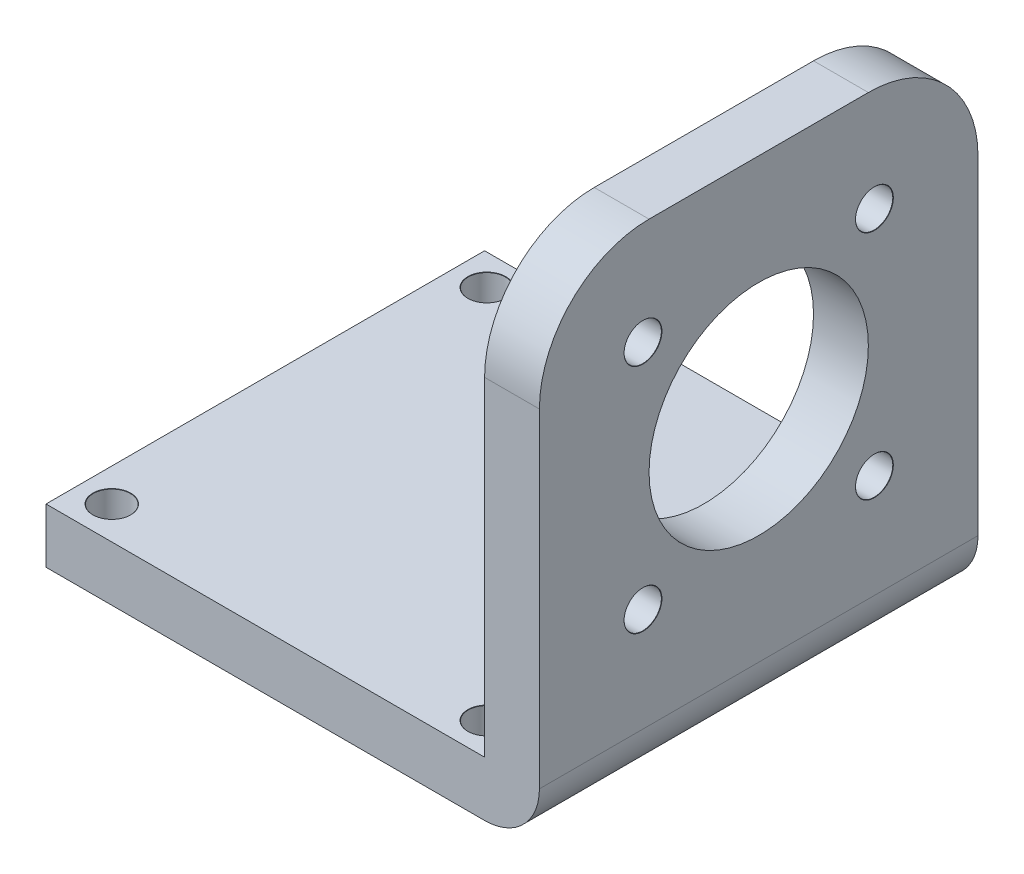
ISO-10303-21;
HEADER;
FILE_DESCRIPTION(('STEP AP214'),'2;1');
FILE_NAME('part.step','',(''),(''),'','','');
FILE_SCHEMA(('AUTOMOTIVE_DESIGN { 1 0 10303 214 1 1 1 1 }'));
ENDSEC;
DATA;
#1=APPLICATION_CONTEXT('core data for automotive mechanical design processes');
#2=APPLICATION_PROTOCOL_DEFINITION('international standard','automotive_design',2000,#1);
#3=PRODUCT_CONTEXT('',#1,'mechanical');
#4=PRODUCT('Part','Part','',(#3));
#5=PRODUCT_RELATED_PRODUCT_CATEGORY('part','',(#4));
#6=PRODUCT_DEFINITION_FORMATION('','',#4);
#7=PRODUCT_DEFINITION_CONTEXT('part definition',#1,'design');
#8=PRODUCT_DEFINITION('design','',#6,#7);
#9=PRODUCT_DEFINITION_SHAPE('','',#8);
#10=(LENGTH_UNIT() NAMED_UNIT(*) SI_UNIT(.MILLI.,.METRE.));
#11=(NAMED_UNIT(*) PLANE_ANGLE_UNIT() SI_UNIT($,.RADIAN.));
#12=(NAMED_UNIT(*) SI_UNIT($,.STERADIAN.) SOLID_ANGLE_UNIT());
#13=UNCERTAINTY_MEASURE_WITH_UNIT(LENGTH_MEASURE(1.E-05),#10,'distance_accuracy_value','');
#14=(GEOMETRIC_REPRESENTATION_CONTEXT(3) GLOBAL_UNCERTAINTY_ASSIGNED_CONTEXT((#13)) GLOBAL_UNIT_ASSIGNED_CONTEXT((#10,
#11,#12)) REPRESENTATION_CONTEXT('',''));
#15=CARTESIAN_POINT('',(0.,0.,0.));
#16=DIRECTION('',(0.,0.,1.));
#17=DIRECTION('',(1.,0.,0.));
#18=AXIS2_PLACEMENT_3D('',#15,#16,#17);
#19=CARTESIAN_POINT('',(25.,35.,-10.));
#20=DIRECTION('',(-1.,0.,0.));
#21=DIRECTION('',(0.,0.,1.));
#22=AXIS2_PLACEMENT_3D('',#19,#20,#21);
#23=CYLINDRICAL_SURFACE('',#22,10.);
#24=DIRECTION('',(-1.,0.,0.));
#25=VECTOR('',#24,1.);
#26=CARTESIAN_POINT('',(25.,45.,-10.));
#27=LINE('',#26,#25);
#28=CARTESIAN_POINT('',(25.,45.,-10.));
#29=VERTEX_POINT('',#28);
#30=CARTESIAN_POINT('',(20.,45.,-10.));
#31=VERTEX_POINT('',#30);
#32=EDGE_CURVE('E185',#29,#31,#27,.T.);
#33=ORIENTED_EDGE('',*,*,#32,.F.);
#34=CARTESIAN_POINT('',(25.,35.,-10.));
#35=DIRECTION('',(1.,0.,0.));
#36=DIRECTION('',(0.,0.,-1.));
#37=AXIS2_PLACEMENT_3D('',#34,#35,#36);
#38=CIRCLE('',#37,10.);
#39=CARTESIAN_POINT('',(25.,35.,-20.));
#40=VERTEX_POINT('',#39);
#41=EDGE_CURVE('E193',#40,#29,#38,.T.);
#42=ORIENTED_EDGE('',*,*,#41,.F.);
#43=DIRECTION('',(-1.,0.,0.));
#44=VECTOR('',#43,1.);
#45=CARTESIAN_POINT('',(20.,35.,-20.));
#46=LINE('',#45,#44);
#47=CARTESIAN_POINT('',(20.,35.,-20.));
#48=VERTEX_POINT('',#47);
#49=EDGE_CURVE('E189',#48,#40,#46,.F.);
#50=ORIENTED_EDGE('',*,*,#49,.F.);
#51=CARTESIAN_POINT('',(20.,35.,-10.));
#52=DIRECTION('',(1.,0.,0.));
#53=DIRECTION('',(0.,0.,-1.));
#54=AXIS2_PLACEMENT_3D('',#51,#52,#53);
#55=CIRCLE('',#54,10.);
#56=EDGE_CURVE('E196',#31,#48,#55,.F.);
#57=ORIENTED_EDGE('',*,*,#56,.F.);
#58=EDGE_LOOP('',(#33,#42,#50,#57));
#59=FACE_BOUND('',#58,.T.);
#60=ADVANCED_FACE('F45',(#59),#23,.T.);
#61=CARTESIAN_POINT('',(25.,35.,10.));
#62=DIRECTION('',(1.,0.,0.));
#63=DIRECTION('',(0.,0.,-1.));
#64=AXIS2_PLACEMENT_3D('',#61,#62,#63);
#65=CYLINDRICAL_SURFACE('',#64,10.);
#66=DIRECTION('',(1.,0.,0.));
#67=VECTOR('',#66,1.);
#68=CARTESIAN_POINT('',(25.,45.,10.));
#69=LINE('',#68,#67);
#70=CARTESIAN_POINT('',(20.,45.,10.));
#71=VERTEX_POINT('',#70);
#72=CARTESIAN_POINT('',(25.,45.,10.));
#73=VERTEX_POINT('',#72);
#74=EDGE_CURVE('E173',#71,#73,#69,.T.);
#75=ORIENTED_EDGE('',*,*,#74,.F.);
#76=CARTESIAN_POINT('',(20.,35.,10.));
#77=DIRECTION('',(1.,0.,0.));
#78=DIRECTION('',(0.,0.,-1.));
#79=AXIS2_PLACEMENT_3D('',#76,#77,#78);
#80=CIRCLE('',#79,10.);
#81=CARTESIAN_POINT('',(20.,35.,20.));
#82=VERTEX_POINT('',#81);
#83=EDGE_CURVE('E179',#82,#71,#80,.F.);
#84=ORIENTED_EDGE('',*,*,#83,.F.);
#85=DIRECTION('',(1.,0.,0.));
#86=VECTOR('',#85,1.);
#87=CARTESIAN_POINT('',(20.,35.,20.));
#88=LINE('',#87,#86);
#89=CARTESIAN_POINT('',(25.,35.,20.));
#90=VERTEX_POINT('',#89);
#91=EDGE_CURVE('E126',#90,#82,#88,.F.);
#92=ORIENTED_EDGE('',*,*,#91,.F.);
#93=CARTESIAN_POINT('',(25.,35.,10.));
#94=DIRECTION('',(1.,0.,0.));
#95=DIRECTION('',(0.,0.,-1.));
#96=AXIS2_PLACEMENT_3D('',#93,#94,#95);
#97=CIRCLE('',#96,10.);
#98=EDGE_CURVE('E182',#73,#90,#97,.T.);
#99=ORIENTED_EDGE('',*,*,#98,.F.);
#100=EDGE_LOOP('',(#75,#84,#92,#99));
#101=FACE_BOUND('',#100,.T.);
#102=ADVANCED_FACE('F273',(#101),#65,.T.);
#103=CARTESIAN_POINT('',(-20.,5.,20.));
#104=DIRECTION('',(1.,0.,0.));
#105=DIRECTION('',(0.,0.,-1.));
#106=AXIS2_PLACEMENT_3D('',#103,#104,#105);
#107=PLANE('',#106);
#108=DIRECTION('',(0.,0.,1.));
#109=VECTOR('',#108,1.);
#110=CARTESIAN_POINT('',(-20.,0.,20.));
#111=LINE('',#110,#109);
#112=CARTESIAN_POINT('',(-20.,0.,-20.));
#113=VERTEX_POINT('',#112);
#114=CARTESIAN_POINT('',(-20.,0.,20.));
#115=VERTEX_POINT('',#114);
#116=EDGE_CURVE('E157',#113,#115,#111,.T.);
#117=ORIENTED_EDGE('',*,*,#116,.T.);
#118=DIRECTION('',(0.,-1.,0.));
#119=VECTOR('',#118,1.);
#120=CARTESIAN_POINT('',(-20.,5.,20.));
#121=LINE('',#120,#119);
#122=CARTESIAN_POINT('',(-20.,5.,20.));
#123=VERTEX_POINT('',#122);
#124=EDGE_CURVE('E170',#123,#115,#121,.T.);
#125=ORIENTED_EDGE('',*,*,#124,.F.);
#126=DIRECTION('',(0.,0.,1.));
#127=VECTOR('',#126,1.);
#128=CARTESIAN_POINT('',(-20.,5.,20.));
#129=LINE('',#128,#127);
#130=CARTESIAN_POINT('',(-20.,5.,-20.));
#131=VERTEX_POINT('',#130);
#132=EDGE_CURVE('E145',#131,#123,#129,.T.);
#133=ORIENTED_EDGE('',*,*,#132,.F.);
#134=DIRECTION('',(0.,-1.,0.));
#135=VECTOR('',#134,1.);
#136=CARTESIAN_POINT('',(-20.,5.,-20.));
#137=LINE('',#136,#135);
#138=EDGE_CURVE('E156',#131,#113,#137,.T.);
#139=ORIENTED_EDGE('',*,*,#138,.T.);
#140=EDGE_LOOP('',(#117,#125,#133,#139));
#141=FACE_BOUND('',#140,.T.);
#142=ADVANCED_FACE('F284',(#141),#107,.F.);
#143=CARTESIAN_POINT('',(20.,5.,20.));
#144=DIRECTION('',(0.,0.,-1.));
#145=DIRECTION('',(-1.,0.,0.));
#146=AXIS2_PLACEMENT_3D('',#143,#144,#145);
#147=PLANE('',#146);
#148=DIRECTION('',(1.,0.,0.));
#149=VECTOR('',#148,1.);
#150=CARTESIAN_POINT('',(20.,0.,20.));
#151=LINE('',#150,#149);
#152=CARTESIAN_POINT('',(20.,0.,20.));
#153=VERTEX_POINT('',#152);
#154=EDGE_CURVE('E161',#115,#153,#151,.T.);
#155=ORIENTED_EDGE('',*,*,#154,.T.);
#156=CARTESIAN_POINT('',(20.,5.,20.));
#157=DIRECTION('',(0.,0.,-1.));
#158=DIRECTION('',(-1.,0.,0.));
#159=AXIS2_PLACEMENT_3D('',#156,#157,#158);
#160=CIRCLE('',#159,5.);
#161=CARTESIAN_POINT('',(25.,5.,20.));
#162=VERTEX_POINT('',#161);
#163=EDGE_CURVE('E11',#153,#162,#160,.F.);
#164=ORIENTED_EDGE('',*,*,#163,.T.);
#165=DIRECTION('',(0.,-1.,0.));
#166=VECTOR('',#165,1.);
#167=CARTESIAN_POINT('',(25.,5.,20.));
#168=LINE('',#167,#166);
#169=EDGE_CURVE('E254',#90,#162,#168,.T.);
#170=ORIENTED_EDGE('',*,*,#169,.F.);
#171=ORIENTED_EDGE('',*,*,#91,.T.);
#172=DIRECTION('',(0.,-1.,0.));
#173=VECTOR('',#172,1.);
#174=CARTESIAN_POINT('',(20.,5.,20.));
#175=LINE('',#174,#173);
#176=CARTESIAN_POINT('',(20.,5.,20.));
#177=VERTEX_POINT('',#176);
#178=EDGE_CURVE('E117',#82,#177,#175,.T.);
#179=ORIENTED_EDGE('',*,*,#178,.T.);
#180=DIRECTION('',(1.,0.,0.));
#181=VECTOR('',#180,1.);
#182=CARTESIAN_POINT('',(20.,5.,20.));
#183=LINE('',#182,#181);
#184=EDGE_CURVE('E122',#123,#177,#183,.T.);
#185=ORIENTED_EDGE('',*,*,#184,.F.);
#186=ORIENTED_EDGE('',*,*,#124,.T.);
#187=EDGE_LOOP('',(#155,#164,#170,#171,#179,#185,#186));
#188=FACE_BOUND('',#187,.T.);
#189=ADVANCED_FACE('F119',(#188),#147,.F.);
#190=CARTESIAN_POINT('',(20.,5.,-20.));
#191=DIRECTION('',(0.,0.,1.));
#192=DIRECTION('',(1.,0.,0.));
#193=AXIS2_PLACEMENT_3D('',#190,#191,#192);
#194=PLANE('',#193);
#195=DIRECTION('',(0.,1.,0.));
#196=VECTOR('',#195,1.);
#197=CARTESIAN_POINT('',(25.,5.,-20.));
#198=LINE('',#197,#196);
#199=CARTESIAN_POINT('',(25.,5.,-20.));
#200=VERTEX_POINT('',#199);
#201=EDGE_CURVE('E258',#200,#40,#198,.T.);
#202=ORIENTED_EDGE('',*,*,#201,.F.);
#203=CARTESIAN_POINT('',(20.,5.,-20.));
#204=DIRECTION('',(0.,0.,1.));
#205=DIRECTION('',(1.,0.,0.));
#206=AXIS2_PLACEMENT_3D('',#203,#204,#205);
#207=CIRCLE('',#206,5.);
#208=CARTESIAN_POINT('',(20.,0.,-20.));
#209=VERTEX_POINT('',#208);
#210=EDGE_CURVE('E70',#200,#209,#207,.F.);
#211=ORIENTED_EDGE('',*,*,#210,.T.);
#212=DIRECTION('',(-1.,0.,0.));
#213=VECTOR('',#212,1.);
#214=CARTESIAN_POINT('',(20.,0.,-20.));
#215=LINE('',#214,#213);
#216=EDGE_CURVE('E150',#209,#113,#215,.T.);
#217=ORIENTED_EDGE('',*,*,#216,.T.);
#218=ORIENTED_EDGE('',*,*,#138,.F.);
#219=DIRECTION('',(-1.,0.,0.));
#220=VECTOR('',#219,1.);
#221=CARTESIAN_POINT('',(20.,5.,-20.));
#222=LINE('',#221,#220);
#223=CARTESIAN_POINT('',(20.,5.,-20.));
#224=VERTEX_POINT('',#223);
#225=EDGE_CURVE('E141',#224,#131,#222,.T.);
#226=ORIENTED_EDGE('',*,*,#225,.F.);
#227=DIRECTION('',(0.,1.,0.));
#228=VECTOR('',#227,1.);
#229=CARTESIAN_POINT('',(20.,5.,-20.));
#230=LINE('',#229,#228);
#231=EDGE_CURVE('E130',#224,#48,#230,.T.);
#232=ORIENTED_EDGE('',*,*,#231,.T.);
#233=ORIENTED_EDGE('',*,*,#49,.T.);
#234=EDGE_LOOP('',(#202,#211,#217,#218,#226,#232,#233));
#235=FACE_BOUND('',#234,.T.);
#236=ADVANCED_FACE('F280',(#235),#194,.F.);
#237=CARTESIAN_POINT('',(0.,5.,0.));
#238=DIRECTION('',(0.,1.,0.));
#239=DIRECTION('',(0.,0.,1.));
#240=AXIS2_PLACEMENT_3D('',#237,#238,#239);
#241=PLANE('',#240);
#242=CARTESIAN_POINT('',(-17.0000000000002,5.,-17.1998167393278));
#243=DIRECTION('',(0.,1.,0.));
#244=DIRECTION('',(0.,0.,1.));
#245=AXIS2_PLACEMENT_3D('',#242,#243,#244);
#246=CIRCLE('',#245,1.725);
#247=CARTESIAN_POINT('',(-17.0000000000002,5.,-15.4748167393278));
#248=VERTEX_POINT('',#247);
#249=EDGE_CURVE('E391',#248,#248,#246,.T.);
#250=ORIENTED_EDGE('',*,*,#249,.F.);
#251=EDGE_LOOP('',(#250));
#252=FACE_BOUND('',#251,.T.);
#253=CARTESIAN_POINT('',(17.199816739328,5.,-17.199816739328));
#254=DIRECTION('',(0.,1.,0.));
#255=DIRECTION('',(0.,0.,1.));
#256=AXIS2_PLACEMENT_3D('',#253,#254,#255);
#257=CIRCLE('',#256,1.725);
#258=CARTESIAN_POINT('',(17.199816739328,5.,-15.474816739328));
#259=VERTEX_POINT('',#258);
#260=EDGE_CURVE('E401',#259,#259,#257,.T.);
#261=ORIENTED_EDGE('',*,*,#260,.F.);
#262=EDGE_LOOP('',(#261));
#263=FACE_BOUND('',#262,.T.);
#264=CARTESIAN_POINT('',(17.199816739328,5.,16.9999999999999));
#265=DIRECTION('',(0.,1.,0.));
#266=DIRECTION('',(0.,0.,1.));
#267=AXIS2_PLACEMENT_3D('',#264,#265,#266);
#268=CIRCLE('',#267,1.725);
#269=CARTESIAN_POINT('',(17.199816739328,5.,18.7249999999999));
#270=VERTEX_POINT('',#269);
#271=EDGE_CURVE('E413',#270,#270,#268,.T.);
#272=ORIENTED_EDGE('',*,*,#271,.F.);
#273=EDGE_LOOP('',(#272));
#274=FACE_BOUND('',#273,.T.);
#275=CARTESIAN_POINT('',(-17.,5.,17.));
#276=DIRECTION('',(0.,1.,0.));
#277=DIRECTION('',(0.,0.,1.));
#278=AXIS2_PLACEMENT_3D('',#275,#276,#277);
#279=CIRCLE('',#278,1.725);
#280=CARTESIAN_POINT('',(-17.,5.,18.725));
#281=VERTEX_POINT('',#280);
#282=EDGE_CURVE('E425',#281,#281,#279,.T.);
#283=ORIENTED_EDGE('',*,*,#282,.F.);
#284=EDGE_LOOP('',(#283));
#285=FACE_BOUND('',#284,.T.);
#286=ORIENTED_EDGE('',*,*,#132,.T.);
#287=ORIENTED_EDGE('',*,*,#184,.T.);
#288=DIRECTION('',(0.,0.,-1.));
#289=VECTOR('',#288,1.);
#290=CARTESIAN_POINT('',(20.,5.,20.));
#291=LINE('',#290,#289);
#292=EDGE_CURVE('E134',#177,#224,#291,.T.);
#293=ORIENTED_EDGE('',*,*,#292,.T.);
#294=ORIENTED_EDGE('',*,*,#225,.T.);
#295=EDGE_LOOP('',(#286,#287,#293,#294));
#296=FACE_BOUND('',#295,.T.);
#297=ADVANCED_FACE('F143',(#252,#263,#274,#285,#296),#241,.T.);
#298=CARTESIAN_POINT('',(0.,0.,0.));
#299=DIRECTION('',(0.,1.,0.));
#300=DIRECTION('',(0.,0.,1.));
#301=AXIS2_PLACEMENT_3D('',#298,#299,#300);
#302=PLANE('',#301);
#303=CARTESIAN_POINT('',(-17.0000000000002,0.,-17.1998167393278));
#304=DIRECTION('',(0.,1.,0.));
#305=DIRECTION('',(0.,0.,1.));
#306=AXIS2_PLACEMENT_3D('',#303,#304,#305);
#307=CIRCLE('',#306,1.69999999999999);
#308=CARTESIAN_POINT('',(-17.0000000000002,0.,-15.4998167393278));
#309=VERTEX_POINT('',#308);
#310=EDGE_CURVE('E395',#309,#309,#307,.T.);
#311=ORIENTED_EDGE('',*,*,#310,.T.);
#312=EDGE_LOOP('',(#311));
#313=FACE_BOUND('',#312,.T.);
#314=CARTESIAN_POINT('',(17.199816739328,0.,-17.199816739328));
#315=DIRECTION('',(0.,1.,0.));
#316=DIRECTION('',(0.,0.,1.));
#317=AXIS2_PLACEMENT_3D('',#314,#315,#316);
#318=CIRCLE('',#317,1.69999999999999);
#319=CARTESIAN_POINT('',(17.199816739328,0.,-15.499816739328));
#320=VERTEX_POINT('',#319);
#321=EDGE_CURVE('E409',#320,#320,#318,.T.);
#322=ORIENTED_EDGE('',*,*,#321,.T.);
#323=EDGE_LOOP('',(#322));
#324=FACE_BOUND('',#323,.T.);
#325=CARTESIAN_POINT('',(17.199816739328,0.,16.9999999999999));
#326=DIRECTION('',(0.,1.,0.));
#327=DIRECTION('',(0.,0.,1.));
#328=AXIS2_PLACEMENT_3D('',#325,#326,#327);
#329=CIRCLE('',#328,1.69999999999999);
#330=CARTESIAN_POINT('',(17.199816739328,0.,18.6999999999999));
#331=VERTEX_POINT('',#330);
#332=EDGE_CURVE('E421',#331,#331,#329,.T.);
#333=ORIENTED_EDGE('',*,*,#332,.T.);
#334=EDGE_LOOP('',(#333));
#335=FACE_BOUND('',#334,.T.);
#336=CARTESIAN_POINT('',(-17.,0.,17.));
#337=DIRECTION('',(0.,1.,0.));
#338=DIRECTION('',(0.,0.,1.));
#339=AXIS2_PLACEMENT_3D('',#336,#337,#338);
#340=CIRCLE('',#339,1.69999999999999);
#341=CARTESIAN_POINT('',(-17.,0.,18.7));
#342=VERTEX_POINT('',#341);
#343=EDGE_CURVE('E433',#342,#342,#340,.T.);
#344=ORIENTED_EDGE('',*,*,#343,.T.);
#345=EDGE_LOOP('',(#344));
#346=FACE_BOUND('',#345,.T.);
#347=ORIENTED_EDGE('',*,*,#216,.F.);
#348=DIRECTION('',(0.,0.,-1.));
#349=VECTOR('',#348,1.);
#350=CARTESIAN_POINT('',(20.,0.,20.));
#351=LINE('',#350,#349);
#352=EDGE_CURVE('E55',#209,#153,#351,.F.);
#353=ORIENTED_EDGE('',*,*,#352,.T.);
#354=ORIENTED_EDGE('',*,*,#154,.F.);
#355=ORIENTED_EDGE('',*,*,#116,.F.);
#356=EDGE_LOOP('',(#347,#353,#354,#355));
#357=FACE_BOUND('',#356,.T.);
#358=ADVANCED_FACE('F310',(#313,#324,#335,#346,#357),#302,.F.);
#359=CARTESIAN_POINT('',(25.,45.,20.));
#360=DIRECTION('',(0.,-1.,0.));
#361=DIRECTION('',(0.,0.,-1.));
#362=AXIS2_PLACEMENT_3D('',#359,#360,#361);
#363=PLANE('',#362);
#364=DIRECTION('',(0.,0.,1.));
#365=VECTOR('',#364,1.);
#366=CARTESIAN_POINT('',(25.,45.,20.));
#367=LINE('',#366,#365);
#368=EDGE_CURVE('E162',#29,#73,#367,.T.);
#369=ORIENTED_EDGE('',*,*,#368,.F.);
#370=ORIENTED_EDGE('',*,*,#32,.T.);
#371=DIRECTION('',(0.,0.,1.));
#372=VECTOR('',#371,1.);
#373=CARTESIAN_POINT('',(20.,45.,20.));
#374=LINE('',#373,#372);
#375=EDGE_CURVE('E259',#31,#71,#374,.T.);
#376=ORIENTED_EDGE('',*,*,#375,.T.);
#377=ORIENTED_EDGE('',*,*,#74,.T.);
#378=EDGE_LOOP('',(#369,#370,#376,#377));
#379=FACE_BOUND('',#378,.T.);
#380=ADVANCED_FACE('F268',(#379),#363,.F.);
#381=CARTESIAN_POINT('',(25.,0.,0.));
#382=DIRECTION('',(1.,0.,0.));
#383=DIRECTION('',(0.,0.,-1.));
#384=AXIS2_PLACEMENT_3D('',#381,#382,#383);
#385=PLANE('',#384);
#386=CARTESIAN_POINT('',(25.,14.4465067463817,10.5534932536183));
#387=DIRECTION('',(1.,0.,0.));
#388=DIRECTION('',(0.,0.,-1.));
#389=AXIS2_PLACEMENT_3D('',#386,#387,#388);
#390=CIRCLE('',#389,1.725);
#391=CARTESIAN_POINT('',(25.,14.4465067463817,8.82849325361828));
#392=VERTEX_POINT('',#391);
#393=EDGE_CURVE('E437',#392,#392,#390,.T.);
#394=ORIENTED_EDGE('',*,*,#393,.F.);
#395=EDGE_LOOP('',(#394));
#396=FACE_BOUND('',#395,.T.);
#397=CARTESIAN_POINT('',(25.,14.4465067463818,-10.5534932536184));
#398=DIRECTION('',(1.,0.,0.));
#399=DIRECTION('',(0.,0.,-1.));
#400=AXIS2_PLACEMENT_3D('',#397,#398,#399);
#401=CIRCLE('',#400,1.725);
#402=CARTESIAN_POINT('',(25.,14.4465067463818,-12.2784932536184));
#403=VERTEX_POINT('',#402);
#404=EDGE_CURVE('E230',#403,#403,#401,.T.);
#405=ORIENTED_EDGE('',*,*,#404,.F.);
#406=EDGE_LOOP('',(#405));
#407=FACE_BOUND('',#406,.T.);
#408=CARTESIAN_POINT('',(25.,35.5534932536184,-10.5534932536182));
#409=DIRECTION('',(1.,0.,0.));
#410=DIRECTION('',(0.,0.,-1.));
#411=AXIS2_PLACEMENT_3D('',#408,#409,#410);
#412=CIRCLE('',#411,1.725);
#413=CARTESIAN_POINT('',(25.,35.5534932536184,-12.2784932536182));
#414=VERTEX_POINT('',#413);
#415=EDGE_CURVE('E221',#414,#414,#412,.T.);
#416=ORIENTED_EDGE('',*,*,#415,.F.);
#417=EDGE_LOOP('',(#416));
#418=FACE_BOUND('',#417,.T.);
#419=CARTESIAN_POINT('',(25.,35.5534932536182,10.5534932536184));
#420=DIRECTION('',(1.,0.,0.));
#421=DIRECTION('',(0.,0.,-1.));
#422=AXIS2_PLACEMENT_3D('',#419,#420,#421);
#423=CIRCLE('',#422,1.725);
#424=CARTESIAN_POINT('',(25.,35.5534932536182,8.82849325361843));
#425=VERTEX_POINT('',#424);
#426=EDGE_CURVE('E216',#425,#425,#423,.T.);
#427=ORIENTED_EDGE('',*,*,#426,.F.);
#428=EDGE_LOOP('',(#427));
#429=FACE_BOUND('',#428,.T.);
#430=CARTESIAN_POINT('',(25.,25.,0.));
#431=DIRECTION('',(-1.,0.,0.));
#432=DIRECTION('',(0.,0.,1.));
#433=AXIS2_PLACEMENT_3D('',#430,#431,#432);
#434=CIRCLE('',#433,10.);
#435=CARTESIAN_POINT('',(25.,25.,10.));
#436=VERTEX_POINT('',#435);
#437=EDGE_CURVE('E131',#436,#436,#434,.T.);
#438=ORIENTED_EDGE('',*,*,#437,.T.);
#439=EDGE_LOOP('',(#438));
#440=FACE_BOUND('',#439,.T.);
#441=ORIENTED_EDGE('',*,*,#169,.T.);
#442=DIRECTION('',(0.,0.,-1.));
#443=VECTOR('',#442,1.);
#444=CARTESIAN_POINT('',(25.,5.,-20.));
#445=LINE('',#444,#443);
#446=EDGE_CURVE('E199',#162,#200,#445,.T.);
#447=ORIENTED_EDGE('',*,*,#446,.T.);
#448=ORIENTED_EDGE('',*,*,#201,.T.);
#449=ORIENTED_EDGE('',*,*,#41,.T.);
#450=ORIENTED_EDGE('',*,*,#368,.T.);
#451=ORIENTED_EDGE('',*,*,#98,.T.);
#452=EDGE_LOOP('',(#441,#447,#448,#449,#450,#451));
#453=FACE_BOUND('',#452,.T.);
#454=ADVANCED_FACE('F275',(#396,#407,#418,#429,#440,#453),#385,.T.);
#455=CARTESIAN_POINT('',(20.,0.,0.));
#456=DIRECTION('',(1.,0.,0.));
#457=DIRECTION('',(0.,0.,-1.));
#458=AXIS2_PLACEMENT_3D('',#455,#456,#457);
#459=PLANE('',#458);
#460=CARTESIAN_POINT('',(20.,14.4465067463817,10.5534932536183));
#461=DIRECTION('',(1.,0.,0.));
#462=DIRECTION('',(0.,0.,-1.));
#463=AXIS2_PLACEMENT_3D('',#460,#461,#462);
#464=CIRCLE('',#463,1.69999999999999);
#465=CARTESIAN_POINT('',(20.,14.4465067463817,8.85349325361829));
#466=VERTEX_POINT('',#465);
#467=EDGE_CURVE('E49',#466,#466,#464,.T.);
#468=ORIENTED_EDGE('',*,*,#467,.T.);
#469=EDGE_LOOP('',(#468));
#470=FACE_BOUND('',#469,.T.);
#471=CARTESIAN_POINT('',(20.,14.4465067463818,-10.5534932536184));
#472=DIRECTION('',(1.,0.,0.));
#473=DIRECTION('',(0.,0.,-1.));
#474=AXIS2_PLACEMENT_3D('',#471,#472,#473);
#475=CIRCLE('',#474,1.69999999999999);
#476=CARTESIAN_POINT('',(20.,14.4465067463818,-12.2534932536184));
#477=VERTEX_POINT('',#476);
#478=EDGE_CURVE('E218',#477,#477,#475,.T.);
#479=ORIENTED_EDGE('',*,*,#478,.T.);
#480=EDGE_LOOP('',(#479));
#481=FACE_BOUND('',#480,.T.);
#482=CARTESIAN_POINT('',(20.,35.5534932536184,-10.5534932536182));
#483=DIRECTION('',(1.,0.,0.));
#484=DIRECTION('',(0.,0.,-1.));
#485=AXIS2_PLACEMENT_3D('',#482,#483,#484);
#486=CIRCLE('',#485,1.69999999999999);
#487=CARTESIAN_POINT('',(20.,35.5534932536184,-12.2534932536182));
#488=VERTEX_POINT('',#487);
#489=EDGE_CURVE('E213',#488,#488,#486,.T.);
#490=ORIENTED_EDGE('',*,*,#489,.T.);
#491=EDGE_LOOP('',(#490));
#492=FACE_BOUND('',#491,.T.);
#493=CARTESIAN_POINT('',(20.,35.5534932536182,10.5534932536184));
#494=DIRECTION('',(1.,0.,0.));
#495=DIRECTION('',(0.,0.,-1.));
#496=AXIS2_PLACEMENT_3D('',#493,#494,#495);
#497=CIRCLE('',#496,1.69999999999999);
#498=CARTESIAN_POINT('',(20.,35.5534932536182,8.85349325361844));
#499=VERTEX_POINT('',#498);
#500=EDGE_CURVE('E207',#499,#499,#497,.T.);
#501=ORIENTED_EDGE('',*,*,#500,.T.);
#502=EDGE_LOOP('',(#501));
#503=FACE_BOUND('',#502,.T.);
#504=CARTESIAN_POINT('',(20.,25.,0.));
#505=DIRECTION('',(-1.,0.,0.));
#506=DIRECTION('',(0.,0.,1.));
#507=AXIS2_PLACEMENT_3D('',#504,#505,#506);
#508=CIRCLE('',#507,10.);
#509=CARTESIAN_POINT('',(20.,25.,10.));
#510=VERTEX_POINT('',#509);
#511=EDGE_CURVE('E211',#510,#510,#508,.T.);
#512=ORIENTED_EDGE('',*,*,#511,.F.);
#513=EDGE_LOOP('',(#512));
#514=FACE_BOUND('',#513,.T.);
#515=ORIENTED_EDGE('',*,*,#375,.F.);
#516=ORIENTED_EDGE('',*,*,#56,.T.);
#517=ORIENTED_EDGE('',*,*,#231,.F.);
#518=ORIENTED_EDGE('',*,*,#292,.F.);
#519=ORIENTED_EDGE('',*,*,#178,.F.);
#520=ORIENTED_EDGE('',*,*,#83,.T.);
#521=EDGE_LOOP('',(#515,#516,#517,#518,#519,#520));
#522=FACE_BOUND('',#521,.T.);
#523=ADVANCED_FACE('F136',(#470,#481,#492,#503,#514,#522),#459,.F.);
#524=CARTESIAN_POINT('',(20.,5.,0.));
#525=DIRECTION('',(0.,0.,1.));
#526=DIRECTION('',(1.,0.,0.));
#527=AXIS2_PLACEMENT_3D('',#524,#525,#526);
#528=CYLINDRICAL_SURFACE('',#527,5.);
#529=ORIENTED_EDGE('',*,*,#163,.F.);
#530=ORIENTED_EDGE('',*,*,#352,.F.);
#531=ORIENTED_EDGE('',*,*,#210,.F.);
#532=ORIENTED_EDGE('',*,*,#446,.F.);
#533=EDGE_LOOP('',(#529,#530,#531,#532));
#534=FACE_BOUND('',#533,.T.);
#535=ADVANCED_FACE('F47',(#534),#528,.T.);
#536=CARTESIAN_POINT('',(25.,25.,0.));
#537=DIRECTION('',(-1.,0.,0.));
#538=DIRECTION('',(0.,0.,1.));
#539=AXIS2_PLACEMENT_3D('',#536,#537,#538);
#540=CYLINDRICAL_SURFACE('',#539,10.);
#541=ORIENTED_EDGE('',*,*,#437,.F.);
#542=EDGE_LOOP('',(#541));
#543=FACE_BOUND('',#542,.T.);
#544=ORIENTED_EDGE('',*,*,#511,.T.);
#545=EDGE_LOOP('',(#544));
#546=FACE_BOUND('',#545,.T.);
#547=ADVANCED_FACE('F288',(#543,#546),#540,.F.);
#548=CARTESIAN_POINT('',(25.,35.5534932536182,10.5534932536184));
#549=DIRECTION('',(1.,0.,0.));
#550=DIRECTION('',(0.,0.,-1.));
#551=AXIS2_PLACEMENT_3D('',#548,#549,#550);
#552=CYLINDRICAL_SURFACE('',#551,1.69999999999999);
#553=CARTESIAN_POINT('',(24.975,35.5534932536182,10.5534932536184));
#554=DIRECTION('',(1.,0.,0.));
#555=DIRECTION('',(0.,0.,-1.));
#556=AXIS2_PLACEMENT_3D('',#553,#554,#555);
#557=CIRCLE('',#556,1.69999999999999);
#558=CARTESIAN_POINT('',(24.975,35.5534932536182,8.85349325361844));
#559=VERTEX_POINT('',#558);
#560=EDGE_CURVE('E212',#559,#559,#557,.T.);
#561=ORIENTED_EDGE('',*,*,#560,.T.);
#562=EDGE_LOOP('',(#561));
#563=FACE_BOUND('',#562,.T.);
#564=ORIENTED_EDGE('',*,*,#500,.F.);
#565=EDGE_LOOP('',(#564));
#566=FACE_BOUND('',#565,.T.);
#567=ADVANCED_FACE('F293',(#563,#566),#552,.F.);
#568=CARTESIAN_POINT('',(25.,35.5534932536182,10.5534932536184));
#569=DIRECTION('',(1.,0.,0.));
#570=DIRECTION('',(0.,0.,-1.));
#571=AXIS2_PLACEMENT_3D('',#568,#569,#570);
#572=CONICAL_SURFACE('',#571,1.725,0.785398163397448);
#573=ORIENTED_EDGE('',*,*,#560,.F.);
#574=EDGE_LOOP('',(#573));
#575=FACE_BOUND('',#574,.T.);
#576=ORIENTED_EDGE('',*,*,#426,.T.);
#577=EDGE_LOOP('',(#576));
#578=FACE_BOUND('',#577,.T.);
#579=ADVANCED_FACE('F324',(#575,#578),#572,.F.);
#580=CARTESIAN_POINT('',(25.,35.5534932536184,-10.5534932536182));
#581=DIRECTION('',(1.,0.,0.));
#582=DIRECTION('',(0.,0.,-1.));
#583=AXIS2_PLACEMENT_3D('',#580,#581,#582);
#584=CYLINDRICAL_SURFACE('',#583,1.69999999999999);
#585=CARTESIAN_POINT('',(24.975,35.5534932536184,-10.5534932536182));
#586=DIRECTION('',(1.,0.,0.));
#587=DIRECTION('',(0.,0.,-1.));
#588=AXIS2_PLACEMENT_3D('',#585,#586,#587);
#589=CIRCLE('',#588,1.69999999999999);
#590=CARTESIAN_POINT('',(24.975,35.5534932536184,-12.2534932536182));
#591=VERTEX_POINT('',#590);
#592=EDGE_CURVE('E217',#591,#591,#589,.T.);
#593=ORIENTED_EDGE('',*,*,#592,.T.);
#594=EDGE_LOOP('',(#593));
#595=FACE_BOUND('',#594,.T.);
#596=ORIENTED_EDGE('',*,*,#489,.F.);
#597=EDGE_LOOP('',(#596));
#598=FACE_BOUND('',#597,.T.);
#599=ADVANCED_FACE('F328',(#595,#598),#584,.F.);
#600=CARTESIAN_POINT('',(25.,35.5534932536184,-10.5534932536182));
#601=DIRECTION('',(1.,0.,0.));
#602=DIRECTION('',(0.,0.,-1.));
#603=AXIS2_PLACEMENT_3D('',#600,#601,#602);
#604=CONICAL_SURFACE('',#603,1.725,0.785398163397448);
#605=ORIENTED_EDGE('',*,*,#592,.F.);
#606=EDGE_LOOP('',(#605));
#607=FACE_BOUND('',#606,.T.);
#608=ORIENTED_EDGE('',*,*,#415,.T.);
#609=EDGE_LOOP('',(#608));
#610=FACE_BOUND('',#609,.T.);
#611=ADVANCED_FACE('F332',(#607,#610),#604,.F.);
#612=CARTESIAN_POINT('',(25.,14.4465067463818,-10.5534932536184));
#613=DIRECTION('',(1.,0.,0.));
#614=DIRECTION('',(0.,0.,-1.));
#615=AXIS2_PLACEMENT_3D('',#612,#613,#614);
#616=CYLINDRICAL_SURFACE('',#615,1.69999999999999);
#617=CARTESIAN_POINT('',(24.975,14.4465067463818,-10.5534932536184));
#618=DIRECTION('',(1.,0.,0.));
#619=DIRECTION('',(0.,0.,-1.));
#620=AXIS2_PLACEMENT_3D('',#617,#618,#619);
#621=CIRCLE('',#620,1.69999999999999);
#622=CARTESIAN_POINT('',(24.975,14.4465067463818,-12.2534932536184));
#623=VERTEX_POINT('',#622);
#624=EDGE_CURVE('E222',#623,#623,#621,.T.);
#625=ORIENTED_EDGE('',*,*,#624,.T.);
#626=EDGE_LOOP('',(#625));
#627=FACE_BOUND('',#626,.T.);
#628=ORIENTED_EDGE('',*,*,#478,.F.);
#629=EDGE_LOOP('',(#628));
#630=FACE_BOUND('',#629,.T.);
#631=ADVANCED_FACE('F336',(#627,#630),#616,.F.);
#632=CARTESIAN_POINT('',(25.,14.4465067463818,-10.5534932536184));
#633=DIRECTION('',(1.,0.,0.));
#634=DIRECTION('',(0.,0.,-1.));
#635=AXIS2_PLACEMENT_3D('',#632,#633,#634);
#636=CONICAL_SURFACE('',#635,1.725,0.785398163397518);
#637=ORIENTED_EDGE('',*,*,#624,.F.);
#638=EDGE_LOOP('',(#637));
#639=FACE_BOUND('',#638,.T.);
#640=ORIENTED_EDGE('',*,*,#404,.T.);
#641=EDGE_LOOP('',(#640));
#642=FACE_BOUND('',#641,.T.);
#643=ADVANCED_FACE('F340',(#639,#642),#636,.F.);
#644=CARTESIAN_POINT('',(25.,14.4465067463817,10.5534932536183));
#645=DIRECTION('',(1.,0.,0.));
#646=DIRECTION('',(0.,0.,-1.));
#647=AXIS2_PLACEMENT_3D('',#644,#645,#646);
#648=CYLINDRICAL_SURFACE('',#647,1.69999999999999);
#649=CARTESIAN_POINT('',(24.975,14.4465067463817,10.5534932536183));
#650=DIRECTION('',(1.,0.,0.));
#651=DIRECTION('',(0.,0.,-1.));
#652=AXIS2_PLACEMENT_3D('',#649,#650,#651);
#653=CIRCLE('',#652,1.69999999999999);
#654=CARTESIAN_POINT('',(24.975,14.4465067463817,8.85349325361829));
#655=VERTEX_POINT('',#654);
#656=EDGE_CURVE('E440',#655,#655,#653,.T.);
#657=ORIENTED_EDGE('',*,*,#656,.T.);
#658=EDGE_LOOP('',(#657));
#659=FACE_BOUND('',#658,.T.);
#660=ORIENTED_EDGE('',*,*,#467,.F.);
#661=EDGE_LOOP('',(#660));
#662=FACE_BOUND('',#661,.T.);
#663=ADVANCED_FACE('F343',(#659,#662),#648,.F.);
#664=CARTESIAN_POINT('',(25.,14.4465067463817,10.5534932536183));
#665=DIRECTION('',(1.,0.,0.));
#666=DIRECTION('',(0.,0.,-1.));
#667=AXIS2_PLACEMENT_3D('',#664,#665,#666);
#668=CONICAL_SURFACE('',#667,1.725,0.785398163397518);
#669=ORIENTED_EDGE('',*,*,#656,.F.);
#670=EDGE_LOOP('',(#669));
#671=FACE_BOUND('',#670,.T.);
#672=ORIENTED_EDGE('',*,*,#393,.T.);
#673=EDGE_LOOP('',(#672));
#674=FACE_BOUND('',#673,.T.);
#675=ADVANCED_FACE('F347',(#671,#674),#668,.F.);
#676=CARTESIAN_POINT('',(-17.,5.,17.));
#677=DIRECTION('',(0.,1.,0.));
#678=DIRECTION('',(0.,0.,1.));
#679=AXIS2_PLACEMENT_3D('',#676,#677,#678);
#680=CYLINDRICAL_SURFACE('',#679,1.69999999999999);
#681=ORIENTED_EDGE('',*,*,#343,.F.);
#682=EDGE_LOOP('',(#681));
#683=FACE_BOUND('',#682,.T.);
#684=CARTESIAN_POINT('',(-17.,4.97499999999997,17.));
#685=DIRECTION('',(0.,1.,0.));
#686=DIRECTION('',(0.,0.,1.));
#687=AXIS2_PLACEMENT_3D('',#684,#685,#686);
#688=CIRCLE('',#687,1.69999999999999);
#689=CARTESIAN_POINT('',(-17.,4.97499999999997,18.7));
#690=VERTEX_POINT('',#689);
#691=EDGE_CURVE('E429',#690,#690,#688,.T.);
#692=ORIENTED_EDGE('',*,*,#691,.T.);
#693=EDGE_LOOP('',(#692));
#694=FACE_BOUND('',#693,.T.);
#695=ADVANCED_FACE('F351',(#683,#694),#680,.F.);
#696=CARTESIAN_POINT('',(-17.,5.,17.));
#697=DIRECTION('',(0.,1.,0.));
#698=DIRECTION('',(0.,0.,1.));
#699=AXIS2_PLACEMENT_3D('',#696,#697,#698);
#700=CONICAL_SURFACE('',#699,1.725,0.785398163397171);
#701=ORIENTED_EDGE('',*,*,#691,.F.);
#702=EDGE_LOOP('',(#701));
#703=FACE_BOUND('',#702,.T.);
#704=ORIENTED_EDGE('',*,*,#282,.T.);
#705=EDGE_LOOP('',(#704));
#706=FACE_BOUND('',#705,.T.);
#707=ADVANCED_FACE('F355',(#703,#706),#700,.F.);
#708=CARTESIAN_POINT('',(17.199816739328,5.,16.9999999999999));
#709=DIRECTION('',(0.,1.,0.));
#710=DIRECTION('',(0.,0.,1.));
#711=AXIS2_PLACEMENT_3D('',#708,#709,#710);
#712=CYLINDRICAL_SURFACE('',#711,1.69999999999999);
#713=ORIENTED_EDGE('',*,*,#332,.F.);
#714=EDGE_LOOP('',(#713));
#715=FACE_BOUND('',#714,.T.);
#716=CARTESIAN_POINT('',(17.199816739328,4.97499999999997,16.9999999999999));
#717=DIRECTION('',(0.,1.,0.));
#718=DIRECTION('',(0.,0.,1.));
#719=AXIS2_PLACEMENT_3D('',#716,#717,#718);
#720=CIRCLE('',#719,1.69999999999999);
#721=CARTESIAN_POINT('',(17.199816739328,4.97499999999997,18.6999999999999));
#722=VERTEX_POINT('',#721);
#723=EDGE_CURVE('E417',#722,#722,#720,.T.);
#724=ORIENTED_EDGE('',*,*,#723,.T.);
#725=EDGE_LOOP('',(#724));
#726=FACE_BOUND('',#725,.T.);
#727=ADVANCED_FACE('F359',(#715,#726),#712,.F.);
#728=CARTESIAN_POINT('',(17.199816739328,5.,16.9999999999999));
#729=DIRECTION('',(0.,1.,0.));
#730=DIRECTION('',(0.,0.,1.));
#731=AXIS2_PLACEMENT_3D('',#728,#729,#730);
#732=CONICAL_SURFACE('',#731,1.725,0.785398163397136);
#733=ORIENTED_EDGE('',*,*,#723,.F.);
#734=EDGE_LOOP('',(#733));
#735=FACE_BOUND('',#734,.T.);
#736=ORIENTED_EDGE('',*,*,#271,.T.);
#737=EDGE_LOOP('',(#736));
#738=FACE_BOUND('',#737,.T.);
#739=ADVANCED_FACE('F363',(#735,#738),#732,.F.);
#740=CARTESIAN_POINT('',(17.199816739328,5.,-17.199816739328));
#741=DIRECTION('',(0.,1.,0.));
#742=DIRECTION('',(0.,0.,1.));
#743=AXIS2_PLACEMENT_3D('',#740,#741,#742);
#744=CYLINDRICAL_SURFACE('',#743,1.69999999999999);
#745=ORIENTED_EDGE('',*,*,#321,.F.);
#746=EDGE_LOOP('',(#745));
#747=FACE_BOUND('',#746,.T.);
#748=CARTESIAN_POINT('',(17.199816739328,4.97499999999997,-17.199816739328));
#749=DIRECTION('',(0.,1.,0.));
#750=DIRECTION('',(0.,0.,1.));
#751=AXIS2_PLACEMENT_3D('',#748,#749,#750);
#752=CIRCLE('',#751,1.69999999999999);
#753=CARTESIAN_POINT('',(17.199816739328,4.97499999999997,-15.499816739328));
#754=VERTEX_POINT('',#753);
#755=EDGE_CURVE('E405',#754,#754,#752,.T.);
#756=ORIENTED_EDGE('',*,*,#755,.T.);
#757=EDGE_LOOP('',(#756));
#758=FACE_BOUND('',#757,.T.);
#759=ADVANCED_FACE('F367',(#747,#758),#744,.F.);
#760=CARTESIAN_POINT('',(17.199816739328,5.,-17.199816739328));
#761=DIRECTION('',(0.,1.,0.));
#762=DIRECTION('',(0.,0.,1.));
#763=AXIS2_PLACEMENT_3D('',#760,#761,#762);
#764=CONICAL_SURFACE('',#763,1.725,0.785398163397205);
#765=ORIENTED_EDGE('',*,*,#755,.F.);
#766=EDGE_LOOP('',(#765));
#767=FACE_BOUND('',#766,.T.);
#768=ORIENTED_EDGE('',*,*,#260,.T.);
#769=EDGE_LOOP('',(#768));
#770=FACE_BOUND('',#769,.T.);
#771=ADVANCED_FACE('F371',(#767,#770),#764,.F.);
#772=CARTESIAN_POINT('',(-17.0000000000002,5.,-17.1998167393278));
#773=DIRECTION('',(0.,1.,0.));
#774=DIRECTION('',(0.,0.,1.));
#775=AXIS2_PLACEMENT_3D('',#772,#773,#774);
#776=CYLINDRICAL_SURFACE('',#775,1.69999999999999);
#777=ORIENTED_EDGE('',*,*,#310,.F.);
#778=EDGE_LOOP('',(#777));
#779=FACE_BOUND('',#778,.T.);
#780=CARTESIAN_POINT('',(-17.0000000000002,4.97499999999997,-17.1998167393278));
#781=DIRECTION('',(0.,1.,0.));
#782=DIRECTION('',(0.,0.,1.));
#783=AXIS2_PLACEMENT_3D('',#780,#781,#782);
#784=CIRCLE('',#783,1.69999999999999);
#785=CARTESIAN_POINT('',(-17.0000000000002,4.97499999999997,-15.4998167393278));
#786=VERTEX_POINT('',#785);
#787=EDGE_CURVE('E388',#786,#786,#784,.T.);
#788=ORIENTED_EDGE('',*,*,#787,.T.);
#789=EDGE_LOOP('',(#788));
#790=FACE_BOUND('',#789,.T.);
#791=ADVANCED_FACE('F375',(#779,#790),#776,.F.);
#792=CARTESIAN_POINT('',(-17.0000000000002,5.,-17.1998167393278));
#793=DIRECTION('',(0.,1.,0.));
#794=DIRECTION('',(0.,0.,1.));
#795=AXIS2_PLACEMENT_3D('',#792,#793,#794);
#796=CONICAL_SURFACE('',#795,1.725,0.785398163397171);
#797=ORIENTED_EDGE('',*,*,#787,.F.);
#798=EDGE_LOOP('',(#797));
#799=FACE_BOUND('',#798,.T.);
#800=ORIENTED_EDGE('',*,*,#249,.T.);
#801=EDGE_LOOP('',(#800));
#802=FACE_BOUND('',#801,.T.);
#803=ADVANCED_FACE('F379',(#799,#802),#796,.F.);
#804=CLOSED_SHELL('',(#60,#102,#142,#189,#236,#297,#358,#380,#454,#523,#535,#547,#567,#579,#599,
#611,#631,#643,#663,#675,#695,#707,#727,#739,#759,#771,#791,#803));
#805=MANIFOLD_SOLID_BREP('B2',#804);
#806=ADVANCED_BREP_SHAPE_REPRESENTATION('',(#18,#805),#14);
#807=SHAPE_DEFINITION_REPRESENTATION(#9,#806);
ENDSEC;
END-ISO-10303-21;
